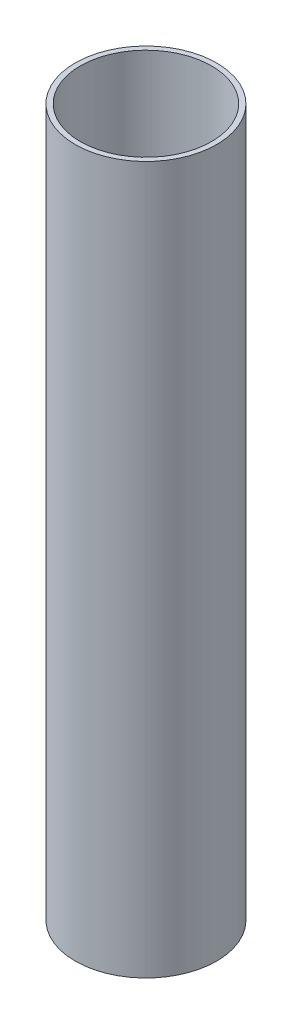
ISO-10303-21;
HEADER;
FILE_DESCRIPTION(('STEP AP214'),'2;1');
FILE_NAME('part.step','',(''),(''),'','','');
FILE_SCHEMA(('AUTOMOTIVE_DESIGN { 1 0 10303 214 1 1 1 1 }'));
ENDSEC;
DATA;
#1=APPLICATION_CONTEXT('core data for automotive mechanical design processes');
#2=APPLICATION_PROTOCOL_DEFINITION('international standard','automotive_design',2000,#1);
#3=PRODUCT_CONTEXT('',#1,'mechanical');
#4=PRODUCT('Part','Part','',(#3));
#5=PRODUCT_RELATED_PRODUCT_CATEGORY('part','',(#4));
#6=PRODUCT_DEFINITION_FORMATION('','',#4);
#7=PRODUCT_DEFINITION_CONTEXT('part definition',#1,'design');
#8=PRODUCT_DEFINITION('design','',#6,#7);
#9=PRODUCT_DEFINITION_SHAPE('','',#8);
#10=(LENGTH_UNIT() NAMED_UNIT(*) SI_UNIT(.MILLI.,.METRE.));
#11=(NAMED_UNIT(*) PLANE_ANGLE_UNIT() SI_UNIT($,.RADIAN.));
#12=(NAMED_UNIT(*) SI_UNIT($,.STERADIAN.) SOLID_ANGLE_UNIT());
#13=UNCERTAINTY_MEASURE_WITH_UNIT(LENGTH_MEASURE(1.E-05),#10,'distance_accuracy_value','');
#14=(GEOMETRIC_REPRESENTATION_CONTEXT(3) GLOBAL_UNCERTAINTY_ASSIGNED_CONTEXT((#13)) GLOBAL_UNIT_ASSIGNED_CONTEXT((#10,
#11,#12)) REPRESENTATION_CONTEXT('',''));
#15=CARTESIAN_POINT('',(0.,0.,0.));
#16=DIRECTION('',(0.,0.,1.));
#17=DIRECTION('',(1.,0.,0.));
#18=AXIS2_PLACEMENT_3D('',#15,#16,#17);
#19=CARTESIAN_POINT('',(0.,125.,0.));
#20=DIRECTION('',(0.,1.,0.));
#21=DIRECTION('',(0.,0.,1.));
#22=AXIS2_PLACEMENT_3D('',#19,#20,#21);
#23=PLANE('',#22);
#24=CARTESIAN_POINT('',(0.,125.,0.));
#25=DIRECTION('',(0.,1.,0.));
#26=DIRECTION('',(0.,0.,1.));
#27=AXIS2_PLACEMENT_3D('',#24,#25,#26);
#28=CIRCLE('',#27,25.);
#29=CARTESIAN_POINT('',(0.,125.,25.));
#30=VERTEX_POINT('',#29);
#31=EDGE_CURVE('E10',#30,#30,#28,.T.);
#32=ORIENTED_EDGE('',*,*,#31,.T.);
#33=EDGE_LOOP('',(#32));
#34=FACE_BOUND('',#33,.T.);
#35=CARTESIAN_POINT('',(0.,125.,0.));
#36=DIRECTION('',(0.,1.,0.));
#37=DIRECTION('',(0.,0.,1.));
#38=AXIS2_PLACEMENT_3D('',#35,#36,#37);
#39=CIRCLE('',#38,23.2);
#40=CARTESIAN_POINT('',(0.,125.,23.2));
#41=VERTEX_POINT('',#40);
#42=EDGE_CURVE('E43',#41,#41,#39,.T.);
#43=ORIENTED_EDGE('',*,*,#42,.F.);
#44=EDGE_LOOP('',(#43));
#45=FACE_BOUND('',#44,.T.);
#46=ADVANCED_FACE('F32',(#34,#45),#23,.T.);
#47=CARTESIAN_POINT('',(0.,-125.,0.));
#48=DIRECTION('',(0.,1.,0.));
#49=DIRECTION('',(0.,0.,1.));
#50=AXIS2_PLACEMENT_3D('',#47,#48,#49);
#51=PLANE('',#50);
#52=CARTESIAN_POINT('',(0.,-125.,0.));
#53=DIRECTION('',(0.,1.,0.));
#54=DIRECTION('',(0.,0.,1.));
#55=AXIS2_PLACEMENT_3D('',#52,#53,#54);
#56=CIRCLE('',#55,25.);
#57=CARTESIAN_POINT('',(0.,-125.,25.));
#58=VERTEX_POINT('',#57);
#59=EDGE_CURVE('E36',#58,#58,#56,.T.);
#60=ORIENTED_EDGE('',*,*,#59,.F.);
#61=EDGE_LOOP('',(#60));
#62=FACE_BOUND('',#61,.T.);
#63=CARTESIAN_POINT('',(0.,-125.,0.));
#64=DIRECTION('',(0.,1.,0.));
#65=DIRECTION('',(0.,0.,1.));
#66=AXIS2_PLACEMENT_3D('',#63,#64,#65);
#67=CIRCLE('',#66,23.2);
#68=CARTESIAN_POINT('',(0.,-125.,23.2));
#69=VERTEX_POINT('',#68);
#70=EDGE_CURVE('E45',#69,#69,#67,.T.);
#71=ORIENTED_EDGE('',*,*,#70,.T.);
#72=EDGE_LOOP('',(#71));
#73=FACE_BOUND('',#72,.T.);
#74=ADVANCED_FACE('F55',(#62,#73),#51,.F.);
#75=CARTESIAN_POINT('',(0.,125.,0.));
#76=DIRECTION('',(0.,-1.,0.));
#77=DIRECTION('',(0.,0.,-1.));
#78=AXIS2_PLACEMENT_3D('',#75,#76,#77);
#79=CYLINDRICAL_SURFACE('',#78,25.);
#80=ORIENTED_EDGE('',*,*,#31,.F.);
#81=EDGE_LOOP('',(#80));
#82=FACE_BOUND('',#81,.T.);
#83=ORIENTED_EDGE('',*,*,#59,.T.);
#84=EDGE_LOOP('',(#83));
#85=FACE_BOUND('',#84,.T.);
#86=ADVANCED_FACE('F34',(#82,#85),#79,.T.);
#87=CARTESIAN_POINT('',(0.,125.,0.));
#88=DIRECTION('',(0.,-1.,0.));
#89=DIRECTION('',(0.,0.,-1.));
#90=AXIS2_PLACEMENT_3D('',#87,#88,#89);
#91=CYLINDRICAL_SURFACE('',#90,23.2);
#92=ORIENTED_EDGE('',*,*,#42,.T.);
#93=EDGE_LOOP('',(#92));
#94=FACE_BOUND('',#93,.T.);
#95=ORIENTED_EDGE('',*,*,#70,.F.);
#96=EDGE_LOOP('',(#95));
#97=FACE_BOUND('',#96,.T.);
#98=ADVANCED_FACE('F51',(#94,#97),#91,.F.);
#99=CLOSED_SHELL('',(#46,#74,#86,#98));
#100=MANIFOLD_SOLID_BREP('B2',#99);
#101=ADVANCED_BREP_SHAPE_REPRESENTATION('',(#18,#100),#14);
#102=SHAPE_DEFINITION_REPRESENTATION(#9,#101);
ENDSEC;
END-ISO-10303-21;
